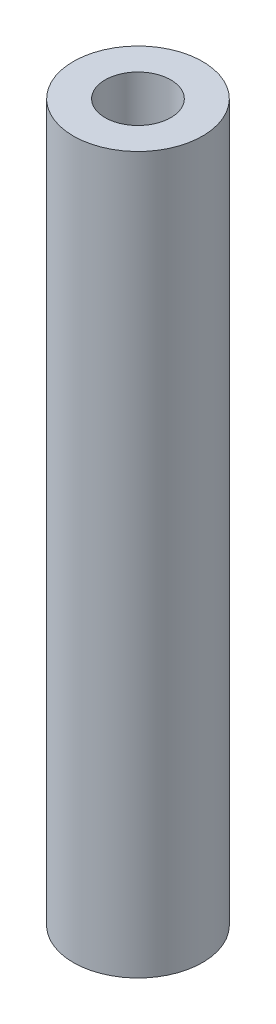
ISO-10303-21;
HEADER;
FILE_DESCRIPTION(('STEP AP214'),'2;1');
FILE_NAME('part.step','',(''),(''),'','','');
FILE_SCHEMA(('AUTOMOTIVE_DESIGN { 1 0 10303 214 1 1 1 1 }'));
ENDSEC;
DATA;
#1=APPLICATION_CONTEXT('core data for automotive mechanical design processes');
#2=APPLICATION_PROTOCOL_DEFINITION('international standard','automotive_design',2000,#1);
#3=PRODUCT_CONTEXT('',#1,'mechanical');
#4=PRODUCT('Part','Part','',(#3));
#5=PRODUCT_RELATED_PRODUCT_CATEGORY('part','',(#4));
#6=PRODUCT_DEFINITION_FORMATION('','',#4);
#7=PRODUCT_DEFINITION_CONTEXT('part definition',#1,'design');
#8=PRODUCT_DEFINITION('design','',#6,#7);
#9=PRODUCT_DEFINITION_SHAPE('','',#8);
#10=(LENGTH_UNIT() NAMED_UNIT(*) SI_UNIT(.MILLI.,.METRE.));
#11=(NAMED_UNIT(*) PLANE_ANGLE_UNIT() SI_UNIT($,.RADIAN.));
#12=(NAMED_UNIT(*) SI_UNIT($,.STERADIAN.) SOLID_ANGLE_UNIT());
#13=UNCERTAINTY_MEASURE_WITH_UNIT(LENGTH_MEASURE(1.E-05),#10,'distance_accuracy_value','');
#14=(GEOMETRIC_REPRESENTATION_CONTEXT(3) GLOBAL_UNCERTAINTY_ASSIGNED_CONTEXT((#13)) GLOBAL_UNIT_ASSIGNED_CONTEXT((#10,
#11,#12)) REPRESENTATION_CONTEXT('',''));
#15=CARTESIAN_POINT('',(0.,0.,0.));
#16=DIRECTION('',(0.,0.,1.));
#17=DIRECTION('',(1.,0.,0.));
#18=AXIS2_PLACEMENT_3D('',#15,#16,#17);
#19=CARTESIAN_POINT('',(0.,18.,0.));
#20=DIRECTION('',(0.,-1.,0.));
#21=DIRECTION('',(0.,0.,-1.));
#22=AXIS2_PLACEMENT_3D('',#19,#20,#21);
#23=CYLINDRICAL_SURFACE('',#22,3.25);
#24=CARTESIAN_POINT('',(0.,18.,0.));
#25=DIRECTION('',(0.,1.,0.));
#26=DIRECTION('',(0.,0.,1.));
#27=AXIS2_PLACEMENT_3D('',#24,#25,#26);
#28=CIRCLE('',#27,3.25);
#29=CARTESIAN_POINT('',(0.,18.,3.25));
#30=VERTEX_POINT('',#29);
#31=EDGE_CURVE('E10',#30,#30,#28,.T.);
#32=ORIENTED_EDGE('',*,*,#31,.F.);
#33=EDGE_LOOP('',(#32));
#34=FACE_BOUND('',#33,.T.);
#35=CARTESIAN_POINT('',(0.,-18.,0.));
#36=DIRECTION('',(0.,1.,0.));
#37=DIRECTION('',(0.,0.,1.));
#38=AXIS2_PLACEMENT_3D('',#35,#36,#37);
#39=CIRCLE('',#38,3.25);
#40=CARTESIAN_POINT('',(0.,-18.,3.25));
#41=VERTEX_POINT('',#40);
#42=EDGE_CURVE('E36',#41,#41,#39,.T.);
#43=ORIENTED_EDGE('',*,*,#42,.T.);
#44=EDGE_LOOP('',(#43));
#45=FACE_BOUND('',#44,.T.);
#46=ADVANCED_FACE('F33',(#34,#45),#23,.T.);
#47=CARTESIAN_POINT('',(0.,18.,0.));
#48=DIRECTION('',(0.,1.,0.));
#49=DIRECTION('',(0.,0.,1.));
#50=AXIS2_PLACEMENT_3D('',#47,#48,#49);
#51=PLANE('',#50);
#52=CARTESIAN_POINT('',(0.,18.,0.));
#53=DIRECTION('',(0.,1.,0.));
#54=DIRECTION('',(0.,0.,1.));
#55=AXIS2_PLACEMENT_3D('',#52,#53,#54);
#56=CIRCLE('',#55,1.65);
#57=CARTESIAN_POINT('',(0.,18.,1.65));
#58=VERTEX_POINT('',#57);
#59=EDGE_CURVE('E47',#58,#58,#56,.T.);
#60=ORIENTED_EDGE('',*,*,#59,.F.);
#61=EDGE_LOOP('',(#60));
#62=FACE_BOUND('',#61,.T.);
#63=ORIENTED_EDGE('',*,*,#31,.T.);
#64=EDGE_LOOP('',(#63));
#65=FACE_BOUND('',#64,.T.);
#66=ADVANCED_FACE('F69',(#62,#65),#51,.T.);
#67=CARTESIAN_POINT('',(0.,-18.,0.));
#68=DIRECTION('',(0.,1.,0.));
#69=DIRECTION('',(0.,0.,1.));
#70=AXIS2_PLACEMENT_3D('',#67,#68,#69);
#71=PLANE('',#70);
#72=CARTESIAN_POINT('',(0.,-18.,0.));
#73=DIRECTION('',(0.,1.,0.));
#74=DIRECTION('',(0.,0.,1.));
#75=AXIS2_PLACEMENT_3D('',#72,#73,#74);
#76=CIRCLE('',#75,2.02499999999999);
#77=CARTESIAN_POINT('',(0.,-18.,2.02499999999999));
#78=VERTEX_POINT('',#77);
#79=EDGE_CURVE('E50',#78,#78,#76,.T.);
#80=ORIENTED_EDGE('',*,*,#79,.T.);
#81=EDGE_LOOP('',(#80));
#82=FACE_BOUND('',#81,.T.);
#83=ORIENTED_EDGE('',*,*,#42,.F.);
#84=EDGE_LOOP('',(#83));
#85=FACE_BOUND('',#84,.T.);
#86=ADVANCED_FACE('F54',(#82,#85),#71,.F.);
#87=CARTESIAN_POINT('',(0.,-17.625,0.));
#88=DIRECTION('',(0.,-1.,0.));
#89=DIRECTION('',(0.,0.,-1.));
#90=AXIS2_PLACEMENT_3D('',#87,#88,#89);
#91=CONICAL_SURFACE('',#90,1.64999999999999,0.785398163397457);
#92=ORIENTED_EDGE('',*,*,#79,.F.);
#93=EDGE_LOOP('',(#92));
#94=FACE_BOUND('',#93,.T.);
#95=CARTESIAN_POINT('',(0.,-17.625,0.));
#96=DIRECTION('',(0.,1.,0.));
#97=DIRECTION('',(0.,0.,1.));
#98=AXIS2_PLACEMENT_3D('',#95,#96,#97);
#99=CIRCLE('',#98,1.64999999999999);
#100=CARTESIAN_POINT('',(0.,-17.625,1.64999999999999));
#101=VERTEX_POINT('',#100);
#102=EDGE_CURVE('E43',#101,#101,#99,.T.);
#103=ORIENTED_EDGE('',*,*,#102,.T.);
#104=EDGE_LOOP('',(#103));
#105=FACE_BOUND('',#104,.T.);
#106=ADVANCED_FACE('F57',(#94,#105),#91,.F.);
#107=CARTESIAN_POINT('',(0.,18.,0.));
#108=DIRECTION('',(0.,1.,0.));
#109=DIRECTION('',(0.,0.,1.));
#110=AXIS2_PLACEMENT_3D('',#107,#108,#109);
#111=CYLINDRICAL_SURFACE('',#110,1.64999999999999);
#112=ORIENTED_EDGE('',*,*,#102,.F.);
#113=EDGE_LOOP('',(#112));
#114=FACE_BOUND('',#113,.T.);
#115=ORIENTED_EDGE('',*,*,#59,.T.);
#116=EDGE_LOOP('',(#115));
#117=FACE_BOUND('',#116,.T.);
#118=ADVANCED_FACE('F60',(#114,#117),#111,.F.);
#119=CLOSED_SHELL('',(#46,#66,#86,#106,#118));
#120=MANIFOLD_SOLID_BREP('B2',#119);
#121=ADVANCED_BREP_SHAPE_REPRESENTATION('',(#18,#120),#14);
#122=SHAPE_DEFINITION_REPRESENTATION(#9,#121);
ENDSEC;
END-ISO-10303-21;
